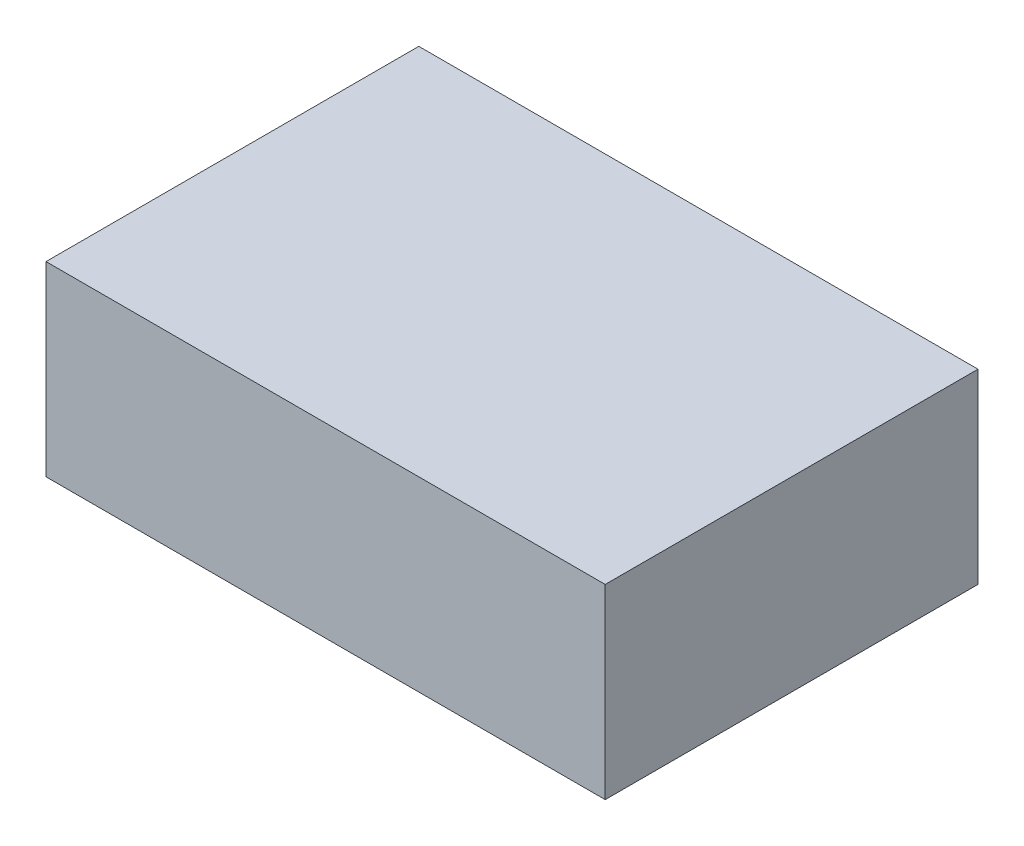
ISO-10303-21;
HEADER;
FILE_DESCRIPTION(('STEP AP214'),'2;1');
FILE_NAME('part.step','',(''),(''),'','','');
FILE_SCHEMA(('AUTOMOTIVE_DESIGN { 1 0 10303 214 1 1 1 1 }'));
ENDSEC;
DATA;
#1=APPLICATION_CONTEXT('core data for automotive mechanical design processes');
#2=APPLICATION_PROTOCOL_DEFINITION('international standard','automotive_design',2000,#1);
#3=PRODUCT_CONTEXT('',#1,'mechanical');
#4=PRODUCT('Part','Part','',(#3));
#5=PRODUCT_RELATED_PRODUCT_CATEGORY('part','',(#4));
#6=PRODUCT_DEFINITION_FORMATION('','',#4);
#7=PRODUCT_DEFINITION_CONTEXT('part definition',#1,'design');
#8=PRODUCT_DEFINITION('design','',#6,#7);
#9=PRODUCT_DEFINITION_SHAPE('','',#8);
#10=(LENGTH_UNIT() NAMED_UNIT(*) SI_UNIT(.MILLI.,.METRE.));
#11=(NAMED_UNIT(*) PLANE_ANGLE_UNIT() SI_UNIT($,.RADIAN.));
#12=(NAMED_UNIT(*) SI_UNIT($,.STERADIAN.) SOLID_ANGLE_UNIT());
#13=UNCERTAINTY_MEASURE_WITH_UNIT(LENGTH_MEASURE(1.E-05),#10,'distance_accuracy_value','');
#14=(GEOMETRIC_REPRESENTATION_CONTEXT(3) GLOBAL_UNCERTAINTY_ASSIGNED_CONTEXT((#13)) GLOBAL_UNIT_ASSIGNED_CONTEXT((#10,
#11,#12)) REPRESENTATION_CONTEXT('',''));
#15=CARTESIAN_POINT('',(0.,0.,0.));
#16=DIRECTION('',(0.,0.,1.));
#17=DIRECTION('',(1.,0.,0.));
#18=AXIS2_PLACEMENT_3D('',#15,#16,#17);
#19=CARTESIAN_POINT('',(0.,0.25,-0.5));
#20=DIRECTION('',(1.,0.,0.));
#21=DIRECTION('',(0.,0.,-1.));
#22=AXIS2_PLACEMENT_3D('',#19,#20,#21);
#23=PLANE('',#22);
#24=DIRECTION('',(0.,0.,1.));
#25=VECTOR('',#24,1.);
#26=CARTESIAN_POINT('',(0.,0.,-0.5));
#27=LINE('',#26,#25);
#28=CARTESIAN_POINT('',(0.,0.,-0.5));
#29=VERTEX_POINT('',#28);
#30=CARTESIAN_POINT('',(0.,0.,0.));
#31=VERTEX_POINT('',#30);
#32=EDGE_CURVE('E111',#29,#31,#27,.T.);
#33=ORIENTED_EDGE('',*,*,#32,.T.);
#34=DIRECTION('',(0.,-1.,0.));
#35=VECTOR('',#34,1.);
#36=CARTESIAN_POINT('',(0.,0.25,0.));
#37=LINE('',#36,#35);
#38=CARTESIAN_POINT('',(0.,0.25,0.));
#39=VERTEX_POINT('',#38);
#40=EDGE_CURVE('E11',#39,#31,#37,.T.);
#41=ORIENTED_EDGE('',*,*,#40,.F.);
#42=DIRECTION('',(0.,0.,1.));
#43=VECTOR('',#42,1.);
#44=CARTESIAN_POINT('',(0.,0.25,-0.5));
#45=LINE('',#44,#43);
#46=CARTESIAN_POINT('',(0.,0.25,-0.5));
#47=VERTEX_POINT('',#46);
#48=EDGE_CURVE('E95',#47,#39,#45,.T.);
#49=ORIENTED_EDGE('',*,*,#48,.F.);
#50=DIRECTION('',(0.,-1.,0.));
#51=VECTOR('',#50,1.);
#52=CARTESIAN_POINT('',(0.,0.25,-0.5));
#53=LINE('',#52,#51);
#54=EDGE_CURVE('E107',#47,#29,#53,.T.);
#55=ORIENTED_EDGE('',*,*,#54,.T.);
#56=EDGE_LOOP('',(#33,#41,#49,#55));
#57=FACE_BOUND('',#56,.T.);
#58=ADVANCED_FACE('F43',(#57),#23,.F.);
#59=CARTESIAN_POINT('',(0.,0.25,0.));
#60=DIRECTION('',(0.,0.,-1.));
#61=DIRECTION('',(-1.,0.,0.));
#62=AXIS2_PLACEMENT_3D('',#59,#60,#61);
#63=PLANE('',#62);
#64=DIRECTION('',(1.,0.,0.));
#65=VECTOR('',#64,1.);
#66=CARTESIAN_POINT('',(0.,0.,0.));
#67=LINE('',#66,#65);
#68=CARTESIAN_POINT('',(0.75,0.,0.));
#69=VERTEX_POINT('',#68);
#70=EDGE_CURVE('E100',#31,#69,#67,.T.);
#71=ORIENTED_EDGE('',*,*,#70,.T.);
#72=DIRECTION('',(0.,-1.,0.));
#73=VECTOR('',#72,1.);
#74=CARTESIAN_POINT('',(0.75,0.25,0.));
#75=LINE('',#74,#73);
#76=CARTESIAN_POINT('',(0.75,0.25,0.));
#77=VERTEX_POINT('',#76);
#78=EDGE_CURVE('E52',#77,#69,#75,.T.);
#79=ORIENTED_EDGE('',*,*,#78,.F.);
#80=DIRECTION('',(1.,0.,0.));
#81=VECTOR('',#80,1.);
#82=CARTESIAN_POINT('',(0.,0.25,0.));
#83=LINE('',#82,#81);
#84=EDGE_CURVE('E90',#39,#77,#83,.T.);
#85=ORIENTED_EDGE('',*,*,#84,.F.);
#86=ORIENTED_EDGE('',*,*,#40,.T.);
#87=EDGE_LOOP('',(#71,#79,#85,#86));
#88=FACE_BOUND('',#87,.T.);
#89=ADVANCED_FACE('F99',(#88),#63,.F.);
#90=CARTESIAN_POINT('',(0.75,0.25,-0.5));
#91=DIRECTION('',(-1.,0.,0.));
#92=DIRECTION('',(0.,0.,1.));
#93=AXIS2_PLACEMENT_3D('',#90,#91,#92);
#94=PLANE('',#93);
#95=DIRECTION('',(0.,0.,-1.));
#96=VECTOR('',#95,1.);
#97=CARTESIAN_POINT('',(0.75,0.,-0.5));
#98=LINE('',#97,#96);
#99=CARTESIAN_POINT('',(0.75,0.,-0.5));
#100=VERTEX_POINT('',#99);
#101=EDGE_CURVE('E77',#69,#100,#98,.T.);
#102=ORIENTED_EDGE('',*,*,#101,.T.);
#103=DIRECTION('',(0.,-1.,0.));
#104=VECTOR('',#103,1.);
#105=CARTESIAN_POINT('',(0.75,0.25,-0.5));
#106=LINE('',#105,#104);
#107=CARTESIAN_POINT('',(0.75,0.25,-0.5));
#108=VERTEX_POINT('',#107);
#109=EDGE_CURVE('E102',#108,#100,#106,.T.);
#110=ORIENTED_EDGE('',*,*,#109,.F.);
#111=DIRECTION('',(0.,0.,-1.));
#112=VECTOR('',#111,1.);
#113=CARTESIAN_POINT('',(0.75,0.25,-0.5));
#114=LINE('',#113,#112);
#115=EDGE_CURVE('E93',#77,#108,#114,.T.);
#116=ORIENTED_EDGE('',*,*,#115,.F.);
#117=ORIENTED_EDGE('',*,*,#78,.T.);
#118=EDGE_LOOP('',(#102,#110,#116,#117));
#119=FACE_BOUND('',#118,.T.);
#120=ADVANCED_FACE('F103',(#119),#94,.F.);
#121=CARTESIAN_POINT('',(0.,0.25,-0.5));
#122=DIRECTION('',(0.,0.,1.));
#123=DIRECTION('',(1.,0.,0.));
#124=AXIS2_PLACEMENT_3D('',#121,#122,#123);
#125=PLANE('',#124);
#126=DIRECTION('',(-1.,0.,0.));
#127=VECTOR('',#126,1.);
#128=CARTESIAN_POINT('',(0.,0.,-0.5));
#129=LINE('',#128,#127);
#130=EDGE_CURVE('E83',#100,#29,#129,.T.);
#131=ORIENTED_EDGE('',*,*,#130,.T.);
#132=ORIENTED_EDGE('',*,*,#54,.F.);
#133=DIRECTION('',(-1.,0.,0.));
#134=VECTOR('',#133,1.);
#135=CARTESIAN_POINT('',(0.,0.25,-0.5));
#136=LINE('',#135,#134);
#137=EDGE_CURVE('E60',#108,#47,#136,.T.);
#138=ORIENTED_EDGE('',*,*,#137,.F.);
#139=ORIENTED_EDGE('',*,*,#109,.T.);
#140=EDGE_LOOP('',(#131,#132,#138,#139));
#141=FACE_BOUND('',#140,.T.);
#142=ADVANCED_FACE('F124',(#141),#125,.F.);
#143=CARTESIAN_POINT('',(0.,0.25,0.));
#144=DIRECTION('',(0.,1.,0.));
#145=DIRECTION('',(0.,0.,1.));
#146=AXIS2_PLACEMENT_3D('',#143,#144,#145);
#147=PLANE('',#146);
#148=ORIENTED_EDGE('',*,*,#48,.T.);
#149=ORIENTED_EDGE('',*,*,#84,.T.);
#150=ORIENTED_EDGE('',*,*,#115,.T.);
#151=ORIENTED_EDGE('',*,*,#137,.T.);
#152=EDGE_LOOP('',(#148,#149,#150,#151));
#153=FACE_BOUND('',#152,.T.);
#154=ADVANCED_FACE('F91',(#153),#147,.T.);
#155=CARTESIAN_POINT('',(0.,0.,0.));
#156=DIRECTION('',(0.,1.,0.));
#157=DIRECTION('',(0.,0.,1.));
#158=AXIS2_PLACEMENT_3D('',#155,#156,#157);
#159=PLANE('',#158);
#160=ORIENTED_EDGE('',*,*,#32,.F.);
#161=ORIENTED_EDGE('',*,*,#130,.F.);
#162=ORIENTED_EDGE('',*,*,#101,.F.);
#163=ORIENTED_EDGE('',*,*,#70,.F.);
#164=EDGE_LOOP('',(#160,#161,#162,#163));
#165=FACE_BOUND('',#164,.T.);
#166=ADVANCED_FACE('F127',(#165),#159,.F.);
#167=CLOSED_SHELL('',(#58,#89,#120,#142,#154,#166));
#168=MANIFOLD_SOLID_BREP('B2',#167);
#169=ADVANCED_BREP_SHAPE_REPRESENTATION('',(#18,#168),#14);
#170=SHAPE_DEFINITION_REPRESENTATION(#9,#169);
ENDSEC;
END-ISO-10303-21;
